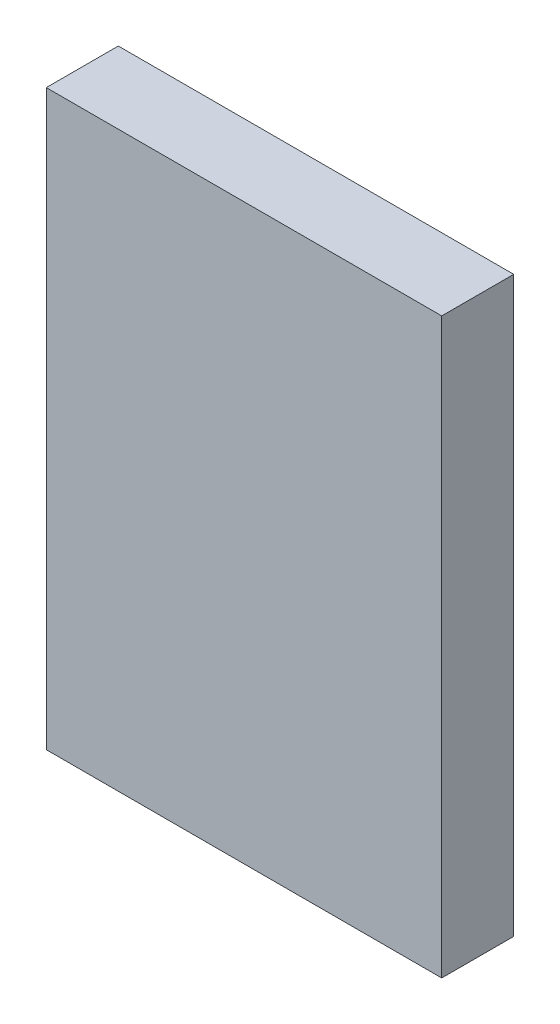
ISO-10303-21;
HEADER;
FILE_DESCRIPTION(('STEP AP214'),'2;1');
FILE_NAME('part.step','',(''),(''),'','','');
FILE_SCHEMA(('AUTOMOTIVE_DESIGN { 1 0 10303 214 1 1 1 1 }'));
ENDSEC;
DATA;
#1=APPLICATION_CONTEXT('core data for automotive mechanical design processes');
#2=APPLICATION_PROTOCOL_DEFINITION('international standard','automotive_design',2000,#1);
#3=PRODUCT_CONTEXT('',#1,'mechanical');
#4=PRODUCT('Part','Part','',(#3));
#5=PRODUCT_RELATED_PRODUCT_CATEGORY('part','',(#4));
#6=PRODUCT_DEFINITION_FORMATION('','',#4);
#7=PRODUCT_DEFINITION_CONTEXT('part definition',#1,'design');
#8=PRODUCT_DEFINITION('design','',#6,#7);
#9=PRODUCT_DEFINITION_SHAPE('','',#8);
#10=(LENGTH_UNIT() NAMED_UNIT(*) SI_UNIT(.MILLI.,.METRE.));
#11=(NAMED_UNIT(*) PLANE_ANGLE_UNIT() SI_UNIT($,.RADIAN.));
#12=(NAMED_UNIT(*) SI_UNIT($,.STERADIAN.) SOLID_ANGLE_UNIT());
#13=UNCERTAINTY_MEASURE_WITH_UNIT(LENGTH_MEASURE(1.E-05),#10,'distance_accuracy_value','');
#14=(GEOMETRIC_REPRESENTATION_CONTEXT(3) GLOBAL_UNCERTAINTY_ASSIGNED_CONTEXT((#13)) GLOBAL_UNIT_ASSIGNED_CONTEXT((#10,
#11,#12)) REPRESENTATION_CONTEXT('',''));
#15=CARTESIAN_POINT('',(0.,0.,0.));
#16=DIRECTION('',(0.,0.,1.));
#17=DIRECTION('',(1.,0.,0.));
#18=AXIS2_PLACEMENT_3D('',#15,#16,#17);
#19=CARTESIAN_POINT('',(-0.14,-1.549,0.));
#20=DIRECTION('',(0.,-1.,0.));
#21=DIRECTION('',(0.,0.,-1.));
#22=AXIS2_PLACEMENT_3D('',#19,#20,#21);
#23=PLANE('',#22);
#24=DIRECTION('',(-1.,0.,0.));
#25=VECTOR('',#24,1.);
#26=CARTESIAN_POINT('',(0.14,-1.549,0.));
#27=LINE('',#26,#25);
#28=CARTESIAN_POINT('',(0.14,-1.549,0.));
#29=VERTEX_POINT('',#28);
#30=CARTESIAN_POINT('',(-0.14,-1.549,0.));
#31=VERTEX_POINT('',#30);
#32=EDGE_CURVE('E11',#29,#31,#27,.T.);
#33=ORIENTED_EDGE('',*,*,#32,.F.);
#34=DIRECTION('',(0.,0.,-1.));
#35=VECTOR('',#34,1.);
#36=CARTESIAN_POINT('',(0.14,-1.549,0.051));
#37=LINE('',#36,#35);
#38=CARTESIAN_POINT('',(0.14,-1.549,0.051));
#39=VERTEX_POINT('',#38);
#40=EDGE_CURVE('E24',#39,#29,#37,.T.);
#41=ORIENTED_EDGE('',*,*,#40,.F.);
#42=DIRECTION('',(1.,0.,0.));
#43=VECTOR('',#42,1.);
#44=CARTESIAN_POINT('',(-0.14,-1.549,0.051));
#45=LINE('',#44,#43);
#46=CARTESIAN_POINT('',(-0.14,-1.549,0.051));
#47=VERTEX_POINT('',#46);
#48=EDGE_CURVE('E88',#47,#39,#45,.T.);
#49=ORIENTED_EDGE('',*,*,#48,.F.);
#50=DIRECTION('',(0.,0.,1.));
#51=VECTOR('',#50,1.);
#52=CARTESIAN_POINT('',(-0.14,-1.549,0.));
#53=LINE('',#52,#51);
#54=EDGE_CURVE('E77',#31,#47,#53,.T.);
#55=ORIENTED_EDGE('',*,*,#54,.F.);
#56=EDGE_LOOP('',(#33,#41,#49,#55));
#57=FACE_BOUND('',#56,.T.);
#58=ADVANCED_FACE('F17',(#57),#23,.T.);
#59=CARTESIAN_POINT('',(0.14,-1.549,0.));
#60=DIRECTION('',(1.,0.,0.));
#61=DIRECTION('',(0.,1.,0.));
#62=AXIS2_PLACEMENT_3D('',#59,#60,#61);
#63=PLANE('',#62);
#64=DIRECTION('',(0.,-1.,0.));
#65=VECTOR('',#64,1.);
#66=CARTESIAN_POINT('',(0.14,-1.143,0.));
#67=LINE('',#66,#65);
#68=CARTESIAN_POINT('',(0.14,-1.143,0.));
#69=VERTEX_POINT('',#68);
#70=EDGE_CURVE('E85',#69,#29,#67,.T.);
#71=ORIENTED_EDGE('',*,*,#70,.F.);
#72=DIRECTION('',(0.,0.,-1.));
#73=VECTOR('',#72,1.);
#74=CARTESIAN_POINT('',(0.14,-1.143,0.051));
#75=LINE('',#74,#73);
#76=CARTESIAN_POINT('',(0.14,-1.143,0.051));
#77=VERTEX_POINT('',#76);
#78=EDGE_CURVE('E83',#77,#69,#75,.T.);
#79=ORIENTED_EDGE('',*,*,#78,.F.);
#80=DIRECTION('',(0.,1.,0.));
#81=VECTOR('',#80,1.);
#82=CARTESIAN_POINT('',(0.14,-1.549,0.051));
#83=LINE('',#82,#81);
#84=EDGE_CURVE('E72',#39,#77,#83,.T.);
#85=ORIENTED_EDGE('',*,*,#84,.F.);
#86=ORIENTED_EDGE('',*,*,#40,.T.);
#87=EDGE_LOOP('',(#71,#79,#85,#86));
#88=FACE_BOUND('',#87,.T.);
#89=ADVANCED_FACE('F90',(#88),#63,.T.);
#90=CARTESIAN_POINT('',(0.14,-1.143,0.));
#91=DIRECTION('',(0.,1.,0.));
#92=DIRECTION('',(1.,0.,0.));
#93=AXIS2_PLACEMENT_3D('',#90,#91,#92);
#94=PLANE('',#93);
#95=DIRECTION('',(1.,0.,0.));
#96=VECTOR('',#95,1.);
#97=CARTESIAN_POINT('',(-0.14,-1.143,0.));
#98=LINE('',#97,#96);
#99=CARTESIAN_POINT('',(-0.14,-1.143,0.));
#100=VERTEX_POINT('',#99);
#101=EDGE_CURVE('E60',#100,#69,#98,.T.);
#102=ORIENTED_EDGE('',*,*,#101,.F.);
#103=DIRECTION('',(0.,0.,-1.));
#104=VECTOR('',#103,1.);
#105=CARTESIAN_POINT('',(-0.14,-1.143,0.051));
#106=LINE('',#105,#104);
#107=CARTESIAN_POINT('',(-0.14,-1.143,0.051));
#108=VERTEX_POINT('',#107);
#109=EDGE_CURVE('E54',#108,#100,#106,.T.);
#110=ORIENTED_EDGE('',*,*,#109,.F.);
#111=DIRECTION('',(-1.,0.,0.));
#112=VECTOR('',#111,1.);
#113=CARTESIAN_POINT('',(0.14,-1.143,0.051));
#114=LINE('',#113,#112);
#115=EDGE_CURVE('E58',#77,#108,#114,.T.);
#116=ORIENTED_EDGE('',*,*,#115,.F.);
#117=ORIENTED_EDGE('',*,*,#78,.T.);
#118=EDGE_LOOP('',(#102,#110,#116,#117));
#119=FACE_BOUND('',#118,.T.);
#120=ADVANCED_FACE('F56',(#119),#94,.T.);
#121=CARTESIAN_POINT('',(-0.14,-1.143,0.));
#122=DIRECTION('',(-1.,0.,0.));
#123=DIRECTION('',(0.,0.,1.));
#124=AXIS2_PLACEMENT_3D('',#121,#122,#123);
#125=PLANE('',#124);
#126=DIRECTION('',(0.,1.,0.));
#127=VECTOR('',#126,1.);
#128=CARTESIAN_POINT('',(-0.14,-1.549,0.));
#129=LINE('',#128,#127);
#130=EDGE_CURVE('E73',#31,#100,#129,.T.);
#131=ORIENTED_EDGE('',*,*,#130,.F.);
#132=ORIENTED_EDGE('',*,*,#54,.T.);
#133=DIRECTION('',(0.,-1.,0.));
#134=VECTOR('',#133,1.);
#135=CARTESIAN_POINT('',(-0.14,-1.143,0.051));
#136=LINE('',#135,#134);
#137=EDGE_CURVE('E70',#108,#47,#136,.T.);
#138=ORIENTED_EDGE('',*,*,#137,.F.);
#139=ORIENTED_EDGE('',*,*,#109,.T.);
#140=EDGE_LOOP('',(#131,#132,#138,#139));
#141=FACE_BOUND('',#140,.T.);
#142=ADVANCED_FACE('F76',(#141),#125,.T.);
#143=CARTESIAN_POINT('',(-0.14,-1.143,0.));
#144=DIRECTION('',(0.,0.,-1.));
#145=DIRECTION('',(0.,-1.,0.));
#146=AXIS2_PLACEMENT_3D('',#143,#144,#145);
#147=PLANE('',#146);
#148=ORIENTED_EDGE('',*,*,#101,.T.);
#149=ORIENTED_EDGE('',*,*,#70,.T.);
#150=ORIENTED_EDGE('',*,*,#32,.T.);
#151=ORIENTED_EDGE('',*,*,#130,.T.);
#152=EDGE_LOOP('',(#148,#149,#150,#151));
#153=FACE_BOUND('',#152,.T.);
#154=ADVANCED_FACE('F91',(#153),#147,.T.);
#155=CARTESIAN_POINT('',(-0.14,-1.549,0.051));
#156=DIRECTION('',(0.,0.,1.));
#157=DIRECTION('',(1.,0.,0.));
#158=AXIS2_PLACEMENT_3D('',#155,#156,#157);
#159=PLANE('',#158);
#160=ORIENTED_EDGE('',*,*,#48,.T.);
#161=ORIENTED_EDGE('',*,*,#84,.T.);
#162=ORIENTED_EDGE('',*,*,#115,.T.);
#163=ORIENTED_EDGE('',*,*,#137,.T.);
#164=EDGE_LOOP('',(#160,#161,#162,#163));
#165=FACE_BOUND('',#164,.T.);
#166=ADVANCED_FACE('F69',(#165),#159,.T.);
#167=CLOSED_SHELL('',(#58,#89,#120,#142,#154,#166));
#168=MANIFOLD_SOLID_BREP('B1',#167);
#169=ADVANCED_BREP_SHAPE_REPRESENTATION('',(#18,#168),#14);
#170=SHAPE_DEFINITION_REPRESENTATION(#9,#169);
ENDSEC;
END-ISO-10303-21;
